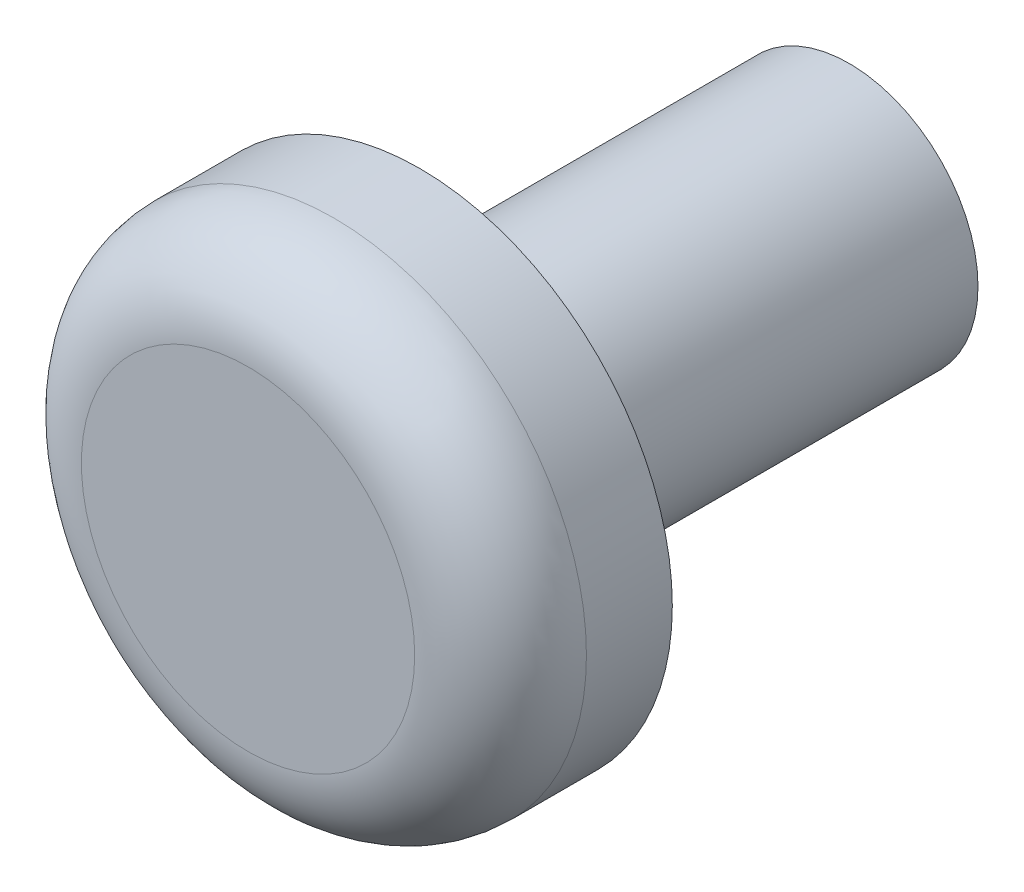
ISO-10303-21;
HEADER;
FILE_DESCRIPTION(('STEP AP214'),'2;1');
FILE_NAME('part.step','',(''),(''),'','','');
FILE_SCHEMA(('AUTOMOTIVE_DESIGN { 1 0 10303 214 1 1 1 1 }'));
ENDSEC;
DATA;
#1=APPLICATION_CONTEXT('core data for automotive mechanical design processes');
#2=APPLICATION_PROTOCOL_DEFINITION('international standard','automotive_design',2000,#1);
#3=PRODUCT_CONTEXT('',#1,'mechanical');
#4=PRODUCT('Part','Part','',(#3));
#5=PRODUCT_RELATED_PRODUCT_CATEGORY('part','',(#4));
#6=PRODUCT_DEFINITION_FORMATION('','',#4);
#7=PRODUCT_DEFINITION_CONTEXT('part definition',#1,'design');
#8=PRODUCT_DEFINITION('design','',#6,#7);
#9=PRODUCT_DEFINITION_SHAPE('','',#8);
#10=(LENGTH_UNIT() NAMED_UNIT(*) SI_UNIT(.MILLI.,.METRE.));
#11=(NAMED_UNIT(*) PLANE_ANGLE_UNIT() SI_UNIT($,.RADIAN.));
#12=(NAMED_UNIT(*) SI_UNIT($,.STERADIAN.) SOLID_ANGLE_UNIT());
#13=UNCERTAINTY_MEASURE_WITH_UNIT(LENGTH_MEASURE(1.E-05),#10,'distance_accuracy_value','');
#14=(GEOMETRIC_REPRESENTATION_CONTEXT(3) GLOBAL_UNCERTAINTY_ASSIGNED_CONTEXT((#13)) GLOBAL_UNIT_ASSIGNED_CONTEXT((#10,
#11,#12)) REPRESENTATION_CONTEXT('',''));
#15=CARTESIAN_POINT('',(0.,0.,0.));
#16=DIRECTION('',(0.,0.,1.));
#17=DIRECTION('',(1.,0.,0.));
#18=AXIS2_PLACEMENT_3D('',#15,#16,#17);
#19=CARTESIAN_POINT('',(0.,0.,5.));
#20=DIRECTION('',(0.,0.,-1.));
#21=DIRECTION('',(-1.,0.,0.));
#22=AXIS2_PLACEMENT_3D('',#19,#20,#21);
#23=CYLINDRICAL_SURFACE('',#22,1.5);
#24=CARTESIAN_POINT('',(0.,0.,5.));
#25=DIRECTION('',(0.,0.,1.));
#26=DIRECTION('',(1.,0.,0.));
#27=AXIS2_PLACEMENT_3D('',#24,#25,#26);
#28=CIRCLE('',#27,1.5);
#29=CARTESIAN_POINT('',(1.5,0.,5.));
#30=VERTEX_POINT('',#29);
#31=EDGE_CURVE('E50',#30,#30,#28,.T.);
#32=ORIENTED_EDGE('',*,*,#31,.F.);
#33=EDGE_LOOP('',(#32));
#34=FACE_BOUND('',#33,.T.);
#35=CARTESIAN_POINT('',(0.,0.,0.));
#36=DIRECTION('',(0.,0.,1.));
#37=DIRECTION('',(1.,0.,0.));
#38=AXIS2_PLACEMENT_3D('',#35,#36,#37);
#39=CIRCLE('',#38,1.5);
#40=CARTESIAN_POINT('',(1.5,0.,0.));
#41=VERTEX_POINT('',#40);
#42=EDGE_CURVE('E55',#41,#41,#39,.T.);
#43=ORIENTED_EDGE('',*,*,#42,.T.);
#44=EDGE_LOOP('',(#43));
#45=FACE_BOUND('',#44,.T.);
#46=ADVANCED_FACE('F37',(#34,#45),#23,.T.);
#47=CARTESIAN_POINT('',(0.,0.,0.));
#48=DIRECTION('',(0.,0.,1.));
#49=DIRECTION('',(1.,0.,0.));
#50=AXIS2_PLACEMENT_3D('',#47,#48,#49);
#51=PLANE('',#50);
#52=ORIENTED_EDGE('',*,*,#42,.F.);
#53=EDGE_LOOP('',(#52));
#54=FACE_BOUND('',#53,.T.);
#55=ADVANCED_FACE('F81',(#54),#51,.F.);
#56=CARTESIAN_POINT('',(0.,0.,7.));
#57=DIRECTION('',(0.,0.,-1.));
#58=DIRECTION('',(-1.,0.,0.));
#59=AXIS2_PLACEMENT_3D('',#56,#57,#58);
#60=CYLINDRICAL_SURFACE('',#59,2.94059701429731);
#61=CARTESIAN_POINT('',(0.,0.,6.));
#62=DIRECTION('',(0.,0.,1.));
#63=DIRECTION('',(1.,0.,0.));
#64=AXIS2_PLACEMENT_3D('',#61,#62,#63);
#65=CIRCLE('',#64,2.94059701429731);
#66=CARTESIAN_POINT('',(2.94059701429731,0.,6.));
#67=VERTEX_POINT('',#66);
#68=EDGE_CURVE('E10',#67,#67,#65,.F.);
#69=ORIENTED_EDGE('',*,*,#68,.T.);
#70=EDGE_LOOP('',(#69));
#71=FACE_BOUND('',#70,.T.);
#72=CARTESIAN_POINT('',(0.,0.,5.));
#73=DIRECTION('',(0.,0.,1.));
#74=DIRECTION('',(1.,0.,0.));
#75=AXIS2_PLACEMENT_3D('',#72,#73,#74);
#76=CIRCLE('',#75,2.94059701429731);
#77=CARTESIAN_POINT('',(2.94059701429731,0.,5.));
#78=VERTEX_POINT('',#77);
#79=EDGE_CURVE('E60',#78,#78,#76,.T.);
#80=ORIENTED_EDGE('',*,*,#79,.T.);
#81=EDGE_LOOP('',(#80));
#82=FACE_BOUND('',#81,.T.);
#83=ADVANCED_FACE('F66',(#71,#82),#60,.T.);
#84=CARTESIAN_POINT('',(0.,0.,7.));
#85=DIRECTION('',(0.,0.,1.));
#86=DIRECTION('',(1.,0.,0.));
#87=AXIS2_PLACEMENT_3D('',#84,#85,#86);
#88=PLANE('',#87);
#89=CARTESIAN_POINT('',(0.,0.,7.));
#90=DIRECTION('',(0.,0.,1.));
#91=DIRECTION('',(1.,0.,0.));
#92=AXIS2_PLACEMENT_3D('',#89,#90,#91);
#93=CIRCLE('',#92,1.94059701429731);
#94=CARTESIAN_POINT('',(1.94059701429731,0.,7.));
#95=VERTEX_POINT('',#94);
#96=EDGE_CURVE('E45',#95,#95,#93,.T.);
#97=ORIENTED_EDGE('',*,*,#96,.T.);
#98=EDGE_LOOP('',(#97));
#99=FACE_BOUND('',#98,.T.);
#100=ADVANCED_FACE('F70',(#99),#88,.T.);
#101=CARTESIAN_POINT('',(0.,0.,5.));
#102=DIRECTION('',(0.,0.,1.));
#103=DIRECTION('',(1.,0.,0.));
#104=AXIS2_PLACEMENT_3D('',#101,#102,#103);
#105=PLANE('',#104);
#106=ORIENTED_EDGE('',*,*,#31,.T.);
#107=EDGE_LOOP('',(#106));
#108=FACE_BOUND('',#107,.T.);
#109=ORIENTED_EDGE('',*,*,#79,.F.);
#110=EDGE_LOOP('',(#109));
#111=FACE_BOUND('',#110,.T.);
#112=ADVANCED_FACE('F68',(#108,#111),#105,.F.);
#113=CARTESIAN_POINT('',(0.,0.,6.));
#114=DIRECTION('',(0.,0.,1.));
#115=DIRECTION('',(1.,0.,0.));
#116=AXIS2_PLACEMENT_3D('',#113,#114,#115);
#117=TOROIDAL_SURFACE('',#116,1.94059701429731,1.);
#118=ORIENTED_EDGE('',*,*,#68,.F.);
#119=EDGE_LOOP('',(#118));
#120=FACE_BOUND('',#119,.T.);
#121=ORIENTED_EDGE('',*,*,#96,.F.);
#122=EDGE_LOOP('',(#121));
#123=FACE_BOUND('',#122,.T.);
#124=ADVANCED_FACE('F39',(#120,#123),#117,.T.);
#125=CLOSED_SHELL('',(#46,#55,#83,#100,#112,#124));
#126=MANIFOLD_SOLID_BREP('B2',#125);
#127=ADVANCED_BREP_SHAPE_REPRESENTATION('',(#18,#126),#14);
#128=SHAPE_DEFINITION_REPRESENTATION(#9,#127);
ENDSEC;
END-ISO-10303-21;
